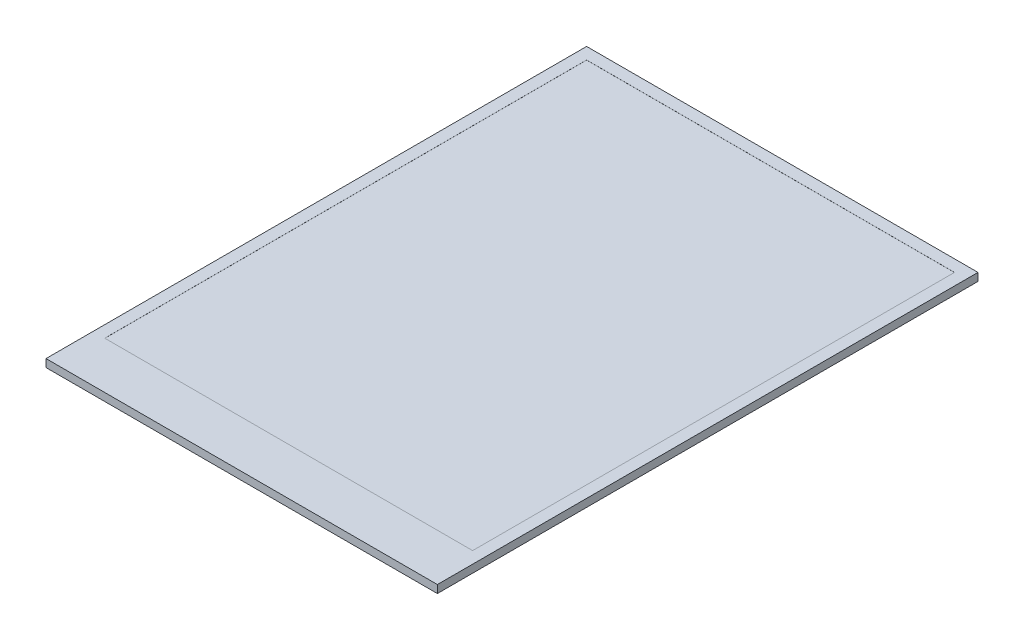
ISO-10303-21;
HEADER;
FILE_DESCRIPTION(('STEP AP214'),'2;1');
FILE_NAME('part.step','',(''),(''),'','','');
FILE_SCHEMA(('AUTOMOTIVE_DESIGN { 1 0 10303 214 1 1 1 1 }'));
ENDSEC;
DATA;
#1=APPLICATION_CONTEXT('core data for automotive mechanical design processes');
#2=APPLICATION_PROTOCOL_DEFINITION('international standard','automotive_design',2000,#1);
#3=PRODUCT_CONTEXT('',#1,'mechanical');
#4=PRODUCT('Part','Part','',(#3));
#5=PRODUCT_RELATED_PRODUCT_CATEGORY('part','',(#4));
#6=PRODUCT_DEFINITION_FORMATION('','',#4);
#7=PRODUCT_DEFINITION_CONTEXT('part definition',#1,'design');
#8=PRODUCT_DEFINITION('design','',#6,#7);
#9=PRODUCT_DEFINITION_SHAPE('','',#8);
#10=(LENGTH_UNIT() NAMED_UNIT(*) SI_UNIT(.MILLI.,.METRE.));
#11=(NAMED_UNIT(*) PLANE_ANGLE_UNIT() SI_UNIT($,.RADIAN.));
#12=(NAMED_UNIT(*) SI_UNIT($,.STERADIAN.) SOLID_ANGLE_UNIT());
#13=UNCERTAINTY_MEASURE_WITH_UNIT(LENGTH_MEASURE(1.E-05),#10,'distance_accuracy_value','');
#14=(GEOMETRIC_REPRESENTATION_CONTEXT(3) GLOBAL_UNCERTAINTY_ASSIGNED_CONTEXT((#13)) GLOBAL_UNIT_ASSIGNED_CONTEXT((#10,
#11,#12)) REPRESENTATION_CONTEXT('',''));
#15=CARTESIAN_POINT('',(0.,0.,0.));
#16=DIRECTION('',(0.,0.,1.));
#17=DIRECTION('',(1.,0.,0.));
#18=AXIS2_PLACEMENT_3D('',#15,#16,#17);
#19=CARTESIAN_POINT('',(0.,1.,0.));
#20=DIRECTION('',(1.,0.,0.));
#21=DIRECTION('',(0.,0.,-1.));
#22=AXIS2_PLACEMENT_3D('',#19,#20,#21);
#23=PLANE('',#22);
#24=DIRECTION('',(0.,0.,1.));
#25=VECTOR('',#24,1.);
#26=CARTESIAN_POINT('',(0.,0.,0.));
#27=LINE('',#26,#25);
#28=CARTESIAN_POINT('',(0.,0.,0.));
#29=VERTEX_POINT('',#28);
#30=CARTESIAN_POINT('',(0.,0.,69.01));
#31=VERTEX_POINT('',#30);
#32=EDGE_CURVE('E159',#29,#31,#27,.T.);
#33=ORIENTED_EDGE('',*,*,#32,.T.);
#34=DIRECTION('',(0.,-1.,0.));
#35=VECTOR('',#34,1.);
#36=CARTESIAN_POINT('',(0.,1.,69.01));
#37=LINE('',#36,#35);
#38=CARTESIAN_POINT('',(0.,1.,69.01));
#39=VERTEX_POINT('',#38);
#40=EDGE_CURVE('E11',#39,#31,#37,.T.);
#41=ORIENTED_EDGE('',*,*,#40,.F.);
#42=DIRECTION('',(0.,0.,1.));
#43=VECTOR('',#42,1.);
#44=CARTESIAN_POINT('',(0.,1.,0.));
#45=LINE('',#44,#43);
#46=CARTESIAN_POINT('',(0.,1.,0.));
#47=VERTEX_POINT('',#46);
#48=EDGE_CURVE('E165',#47,#39,#45,.T.);
#49=ORIENTED_EDGE('',*,*,#48,.F.);
#50=DIRECTION('',(0.,-1.,0.));
#51=VECTOR('',#50,1.);
#52=CARTESIAN_POINT('',(0.,1.,0.));
#53=LINE('',#52,#51);
#54=EDGE_CURVE('E175',#47,#29,#53,.T.);
#55=ORIENTED_EDGE('',*,*,#54,.T.);
#56=EDGE_LOOP('',(#33,#41,#49,#55));
#57=FACE_BOUND('',#56,.T.);
#58=ADVANCED_FACE('F40',(#57),#23,.F.);
#59=CARTESIAN_POINT('',(0.,1.,69.01));
#60=DIRECTION('',(0.,0.,-1.));
#61=DIRECTION('',(-1.,0.,0.));
#62=AXIS2_PLACEMENT_3D('',#59,#60,#61);
#63=PLANE('',#62);
#64=DIRECTION('',(1.,0.,0.));
#65=VECTOR('',#64,1.);
#66=CARTESIAN_POINT('',(0.,0.,69.01));
#67=LINE('',#66,#65);
#68=CARTESIAN_POINT('',(49.96,0.,69.01));
#69=VERTEX_POINT('',#68);
#70=EDGE_CURVE('E179',#31,#69,#67,.T.);
#71=ORIENTED_EDGE('',*,*,#70,.T.);
#72=DIRECTION('',(0.,-1.,0.));
#73=VECTOR('',#72,1.);
#74=CARTESIAN_POINT('',(49.96,1.,69.01));
#75=LINE('',#74,#73);
#76=CARTESIAN_POINT('',(49.96,1.,69.01));
#77=VERTEX_POINT('',#76);
#78=EDGE_CURVE('E48',#77,#69,#75,.T.);
#79=ORIENTED_EDGE('',*,*,#78,.F.);
#80=DIRECTION('',(1.,0.,0.));
#81=VECTOR('',#80,1.);
#82=CARTESIAN_POINT('',(0.,1.,69.01));
#83=LINE('',#82,#81);
#84=EDGE_CURVE('E92',#39,#77,#83,.T.);
#85=ORIENTED_EDGE('',*,*,#84,.F.);
#86=ORIENTED_EDGE('',*,*,#40,.T.);
#87=EDGE_LOOP('',(#71,#79,#85,#86));
#88=FACE_BOUND('',#87,.T.);
#89=ADVANCED_FACE('F215',(#88),#63,.F.);
#90=CARTESIAN_POINT('',(49.96,1.,0.));
#91=DIRECTION('',(-1.,0.,0.));
#92=DIRECTION('',(0.,0.,1.));
#93=AXIS2_PLACEMENT_3D('',#90,#91,#92);
#94=PLANE('',#93);
#95=DIRECTION('',(0.,0.,-1.));
#96=VECTOR('',#95,1.);
#97=CARTESIAN_POINT('',(49.96,0.,0.));
#98=LINE('',#97,#96);
#99=CARTESIAN_POINT('',(49.96,0.,0.));
#100=VERTEX_POINT('',#99);
#101=EDGE_CURVE('E182',#69,#100,#98,.T.);
#102=ORIENTED_EDGE('',*,*,#101,.T.);
#103=DIRECTION('',(0.,-1.,0.));
#104=VECTOR('',#103,1.);
#105=CARTESIAN_POINT('',(49.96,1.,0.));
#106=LINE('',#105,#104);
#107=CARTESIAN_POINT('',(49.96,1.,0.));
#108=VERTEX_POINT('',#107);
#109=EDGE_CURVE('E189',#108,#100,#106,.T.);
#110=ORIENTED_EDGE('',*,*,#109,.F.);
#111=DIRECTION('',(0.,0.,-1.));
#112=VECTOR('',#111,1.);
#113=CARTESIAN_POINT('',(49.96,1.,0.));
#114=LINE('',#113,#112);
#115=EDGE_CURVE('E170',#77,#108,#114,.T.);
#116=ORIENTED_EDGE('',*,*,#115,.F.);
#117=ORIENTED_EDGE('',*,*,#78,.T.);
#118=EDGE_LOOP('',(#102,#110,#116,#117));
#119=FACE_BOUND('',#118,.T.);
#120=ADVANCED_FACE('F196',(#119),#94,.F.);
#121=CARTESIAN_POINT('',(0.,1.,0.));
#122=DIRECTION('',(0.,0.,1.));
#123=DIRECTION('',(1.,0.,0.));
#124=AXIS2_PLACEMENT_3D('',#121,#122,#123);
#125=PLANE('',#124);
#126=DIRECTION('',(-1.,0.,0.));
#127=VECTOR('',#126,1.);
#128=CARTESIAN_POINT('',(0.,0.,0.));
#129=LINE('',#128,#127);
#130=EDGE_CURVE('E85',#100,#29,#129,.T.);
#131=ORIENTED_EDGE('',*,*,#130,.T.);
#132=ORIENTED_EDGE('',*,*,#54,.F.);
#133=DIRECTION('',(-1.,0.,0.));
#134=VECTOR('',#133,1.);
#135=CARTESIAN_POINT('',(0.,1.,0.));
#136=LINE('',#135,#134);
#137=EDGE_CURVE('E64',#108,#47,#136,.T.);
#138=ORIENTED_EDGE('',*,*,#137,.F.);
#139=ORIENTED_EDGE('',*,*,#109,.T.);
#140=EDGE_LOOP('',(#131,#132,#138,#139));
#141=FACE_BOUND('',#140,.T.);
#142=ADVANCED_FACE('F204',(#141),#125,.F.);
#143=CARTESIAN_POINT('',(0.,1.,0.));
#144=DIRECTION('',(0.,1.,0.));
#145=DIRECTION('',(0.,0.,1.));
#146=AXIS2_PLACEMENT_3D('',#143,#144,#145);
#147=PLANE('',#146);
#148=DIRECTION('',(0.,0.,1.));
#149=VECTOR('',#148,1.);
#150=CARTESIAN_POINT('',(1.5,1.,1.5));
#151=LINE('',#150,#149);
#152=CARTESIAN_POINT('',(1.5,1.,1.5));
#153=VERTEX_POINT('',#152);
#154=CARTESIAN_POINT('',(1.50000000000001,1.,63.01));
#155=VERTEX_POINT('',#154);
#156=EDGE_CURVE('E55',#153,#155,#151,.T.);
#157=ORIENTED_EDGE('',*,*,#156,.F.);
#158=DIRECTION('',(-1.,0.,0.));
#159=VECTOR('',#158,1.);
#160=CARTESIAN_POINT('',(1.5,1.,1.5));
#161=LINE('',#160,#159);
#162=CARTESIAN_POINT('',(48.46,1.,1.5));
#163=VERTEX_POINT('',#162);
#164=EDGE_CURVE('E137',#163,#153,#161,.T.);
#165=ORIENTED_EDGE('',*,*,#164,.F.);
#166=DIRECTION('',(0.,0.,-1.));
#167=VECTOR('',#166,1.);
#168=CARTESIAN_POINT('',(48.46,1.,1.5));
#169=LINE('',#168,#167);
#170=CARTESIAN_POINT('',(48.46,1.,63.01));
#171=VERTEX_POINT('',#170);
#172=EDGE_CURVE('E141',#171,#163,#169,.T.);
#173=ORIENTED_EDGE('',*,*,#172,.F.);
#174=DIRECTION('',(1.,0.,0.));
#175=VECTOR('',#174,1.);
#176=CARTESIAN_POINT('',(1.50000000000001,1.,63.01));
#177=LINE('',#176,#175);
#178=EDGE_CURVE('E150',#155,#171,#177,.T.);
#179=ORIENTED_EDGE('',*,*,#178,.F.);
#180=EDGE_LOOP('',(#157,#165,#173,#179));
#181=FACE_BOUND('',#180,.T.);
#182=ORIENTED_EDGE('',*,*,#48,.T.);
#183=ORIENTED_EDGE('',*,*,#84,.T.);
#184=ORIENTED_EDGE('',*,*,#115,.T.);
#185=ORIENTED_EDGE('',*,*,#137,.T.);
#186=EDGE_LOOP('',(#182,#183,#184,#185));
#187=FACE_BOUND('',#186,.T.);
#188=ADVANCED_FACE('F206',(#181,#187),#147,.T.);
#189=CARTESIAN_POINT('',(0.,0.,0.));
#190=DIRECTION('',(0.,1.,0.));
#191=DIRECTION('',(0.,0.,1.));
#192=AXIS2_PLACEMENT_3D('',#189,#190,#191);
#193=PLANE('',#192);
#194=ORIENTED_EDGE('',*,*,#32,.F.);
#195=ORIENTED_EDGE('',*,*,#130,.F.);
#196=ORIENTED_EDGE('',*,*,#101,.F.);
#197=ORIENTED_EDGE('',*,*,#70,.F.);
#198=EDGE_LOOP('',(#194,#195,#196,#197));
#199=FACE_BOUND('',#198,.T.);
#200=ADVANCED_FACE('F200',(#199),#193,.F.);
#201=CARTESIAN_POINT('',(1.5,0.99,1.5));
#202=DIRECTION('',(-1.,0.,0.));
#203=DIRECTION('',(0.,0.,1.));
#204=AXIS2_PLACEMENT_3D('',#201,#202,#203);
#205=PLANE('',#204);
#206=ORIENTED_EDGE('',*,*,#156,.T.);
#207=DIRECTION('',(0.,1.,0.));
#208=VECTOR('',#207,1.);
#209=CARTESIAN_POINT('',(1.50000000000001,0.99,63.01));
#210=LINE('',#209,#208);
#211=CARTESIAN_POINT('',(1.50000000000001,0.99,63.01));
#212=VERTEX_POINT('',#211);
#213=EDGE_CURVE('E112',#212,#155,#210,.T.);
#214=ORIENTED_EDGE('',*,*,#213,.F.);
#215=DIRECTION('',(0.,0.,1.));
#216=VECTOR('',#215,1.);
#217=CARTESIAN_POINT('',(1.5,0.99,1.5));
#218=LINE('',#217,#216);
#219=CARTESIAN_POINT('',(1.5,0.99,1.5));
#220=VERTEX_POINT('',#219);
#221=EDGE_CURVE('E116',#220,#212,#218,.T.);
#222=ORIENTED_EDGE('',*,*,#221,.F.);
#223=DIRECTION('',(0.,1.,0.));
#224=VECTOR('',#223,1.);
#225=CARTESIAN_POINT('',(1.5,0.99,1.5));
#226=LINE('',#225,#224);
#227=EDGE_CURVE('E156',#220,#153,#226,.T.);
#228=ORIENTED_EDGE('',*,*,#227,.T.);
#229=EDGE_LOOP('',(#206,#214,#222,#228));
#230=FACE_BOUND('',#229,.T.);
#231=ADVANCED_FACE('F114',(#230),#205,.F.);
#232=CARTESIAN_POINT('',(1.5,0.99,1.5));
#233=DIRECTION('',(0.,0.,-1.));
#234=DIRECTION('',(-1.,0.,0.));
#235=AXIS2_PLACEMENT_3D('',#232,#233,#234);
#236=PLANE('',#235);
#237=ORIENTED_EDGE('',*,*,#164,.T.);
#238=ORIENTED_EDGE('',*,*,#227,.F.);
#239=DIRECTION('',(-1.,0.,0.));
#240=VECTOR('',#239,1.);
#241=CARTESIAN_POINT('',(1.5,0.99,1.5));
#242=LINE('',#241,#240);
#243=CARTESIAN_POINT('',(48.46,0.99,1.5));
#244=VERTEX_POINT('',#243);
#245=EDGE_CURVE('E123',#244,#220,#242,.T.);
#246=ORIENTED_EDGE('',*,*,#245,.F.);
#247=DIRECTION('',(0.,1.,0.));
#248=VECTOR('',#247,1.);
#249=CARTESIAN_POINT('',(48.46,0.99,1.5));
#250=LINE('',#249,#248);
#251=EDGE_CURVE('E160',#244,#163,#250,.T.);
#252=ORIENTED_EDGE('',*,*,#251,.T.);
#253=EDGE_LOOP('',(#237,#238,#246,#252));
#254=FACE_BOUND('',#253,.T.);
#255=ADVANCED_FACE('F254',(#254),#236,.F.);
#256=CARTESIAN_POINT('',(48.46,0.99,1.5));
#257=DIRECTION('',(1.,0.,0.));
#258=DIRECTION('',(0.,0.,-1.));
#259=AXIS2_PLACEMENT_3D('',#256,#257,#258);
#260=PLANE('',#259);
#261=ORIENTED_EDGE('',*,*,#172,.T.);
#262=ORIENTED_EDGE('',*,*,#251,.F.);
#263=DIRECTION('',(0.,0.,-1.));
#264=VECTOR('',#263,1.);
#265=CARTESIAN_POINT('',(48.46,0.99,1.5));
#266=LINE('',#265,#264);
#267=CARTESIAN_POINT('',(48.46,0.99,63.01));
#268=VERTEX_POINT('',#267);
#269=EDGE_CURVE('E132',#268,#244,#266,.T.);
#270=ORIENTED_EDGE('',*,*,#269,.F.);
#271=DIRECTION('',(0.,1.,0.));
#272=VECTOR('',#271,1.);
#273=CARTESIAN_POINT('',(48.46,0.99,63.01));
#274=LINE('',#273,#272);
#275=EDGE_CURVE('E122',#268,#171,#274,.T.);
#276=ORIENTED_EDGE('',*,*,#275,.T.);
#277=EDGE_LOOP('',(#261,#262,#270,#276));
#278=FACE_BOUND('',#277,.T.);
#279=ADVANCED_FACE('F263',(#278),#260,.F.);
#280=CARTESIAN_POINT('',(1.50000000000001,0.99,63.01));
#281=DIRECTION('',(0.,0.,1.));
#282=DIRECTION('',(1.,0.,0.));
#283=AXIS2_PLACEMENT_3D('',#280,#281,#282);
#284=PLANE('',#283);
#285=ORIENTED_EDGE('',*,*,#178,.T.);
#286=ORIENTED_EDGE('',*,*,#275,.F.);
#287=DIRECTION('',(1.,0.,0.));
#288=VECTOR('',#287,1.);
#289=CARTESIAN_POINT('',(1.50000000000001,0.99,63.01));
#290=LINE('',#289,#288);
#291=EDGE_CURVE('E126',#212,#268,#290,.T.);
#292=ORIENTED_EDGE('',*,*,#291,.F.);
#293=ORIENTED_EDGE('',*,*,#213,.T.);
#294=EDGE_LOOP('',(#285,#286,#292,#293));
#295=FACE_BOUND('',#294,.T.);
#296=ADVANCED_FACE('F127',(#295),#284,.F.);
#297=CARTESIAN_POINT('',(0.,0.99,0.));
#298=DIRECTION('',(0.,1.,0.));
#299=DIRECTION('',(0.,0.,1.));
#300=AXIS2_PLACEMENT_3D('',#297,#298,#299);
#301=PLANE('',#300);
#302=ORIENTED_EDGE('',*,*,#221,.T.);
#303=ORIENTED_EDGE('',*,*,#291,.T.);
#304=ORIENTED_EDGE('',*,*,#269,.T.);
#305=ORIENTED_EDGE('',*,*,#245,.T.);
#306=EDGE_LOOP('',(#302,#303,#304,#305));
#307=FACE_BOUND('',#306,.T.);
#308=ADVANCED_FACE('F134',(#307),#301,.T.);
#309=CLOSED_SHELL('',(#58,#89,#120,#142,#188,#200,#231,#255,#279,#296,#308));
#310=MANIFOLD_SOLID_BREP('B2',#309);
#311=ADVANCED_BREP_SHAPE_REPRESENTATION('',(#18,#310),#14);
#312=SHAPE_DEFINITION_REPRESENTATION(#9,#311);
ENDSEC;
END-ISO-10303-21;
